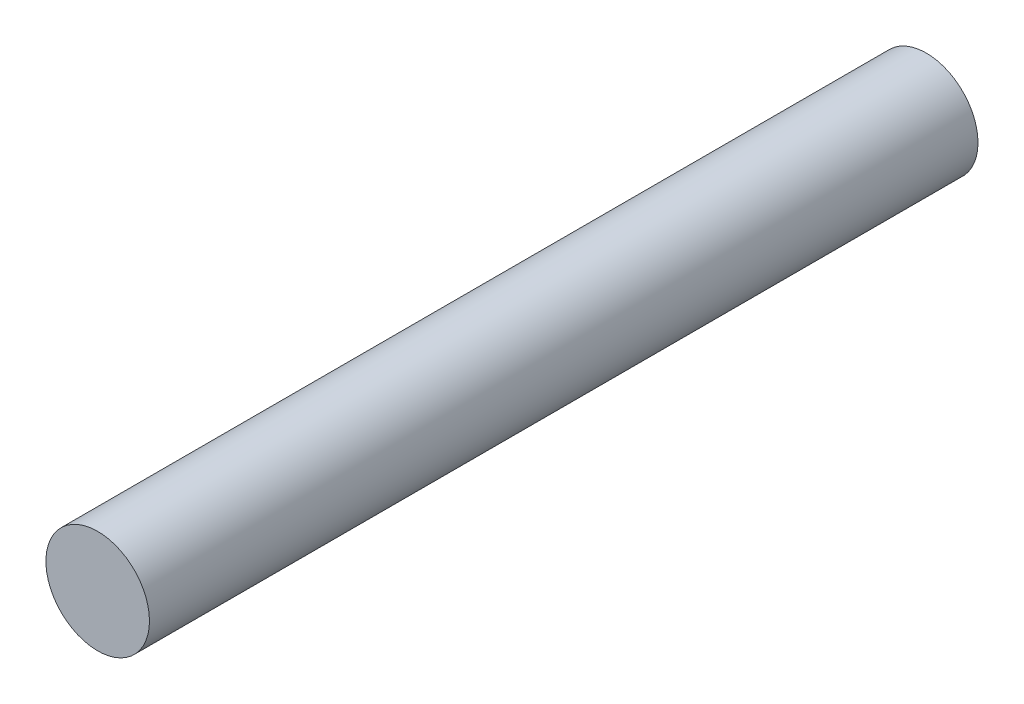
ISO-10303-21;
HEADER;
FILE_DESCRIPTION(('STEP AP214'),'2;1');
FILE_NAME('part.step','',(''),(''),'','','');
FILE_SCHEMA(('AUTOMOTIVE_DESIGN { 1 0 10303 214 1 1 1 1 }'));
ENDSEC;
DATA;
#1=APPLICATION_CONTEXT('core data for automotive mechanical design processes');
#2=APPLICATION_PROTOCOL_DEFINITION('international standard','automotive_design',2000,#1);
#3=PRODUCT_CONTEXT('',#1,'mechanical');
#4=PRODUCT('Part','Part','',(#3));
#5=PRODUCT_RELATED_PRODUCT_CATEGORY('part','',(#4));
#6=PRODUCT_DEFINITION_FORMATION('','',#4);
#7=PRODUCT_DEFINITION_CONTEXT('part definition',#1,'design');
#8=PRODUCT_DEFINITION('design','',#6,#7);
#9=PRODUCT_DEFINITION_SHAPE('','',#8);
#10=(LENGTH_UNIT() NAMED_UNIT(*) SI_UNIT(.MILLI.,.METRE.));
#11=(NAMED_UNIT(*) PLANE_ANGLE_UNIT() SI_UNIT($,.RADIAN.));
#12=(NAMED_UNIT(*) SI_UNIT($,.STERADIAN.) SOLID_ANGLE_UNIT());
#13=UNCERTAINTY_MEASURE_WITH_UNIT(LENGTH_MEASURE(1.E-05),#10,'distance_accuracy_value','');
#14=(GEOMETRIC_REPRESENTATION_CONTEXT(3) GLOBAL_UNCERTAINTY_ASSIGNED_CONTEXT((#13)) GLOBAL_UNIT_ASSIGNED_CONTEXT((#10,
#11,#12)) REPRESENTATION_CONTEXT('',''));
#15=CARTESIAN_POINT('',(0.,0.,0.));
#16=DIRECTION('',(0.,0.,1.));
#17=DIRECTION('',(1.,0.,0.));
#18=AXIS2_PLACEMENT_3D('',#15,#16,#17);
#19=CARTESIAN_POINT('',(0.,0.,40.));
#20=DIRECTION('',(0.,0.,-1.));
#21=DIRECTION('',(-1.,0.,0.));
#22=AXIS2_PLACEMENT_3D('',#19,#20,#21);
#23=CYLINDRICAL_SURFACE('',#22,2.5);
#24=CARTESIAN_POINT('',(0.,0.,40.));
#25=DIRECTION('',(0.,0.,1.));
#26=DIRECTION('',(1.,0.,0.));
#27=AXIS2_PLACEMENT_3D('',#24,#25,#26);
#28=CIRCLE('',#27,2.5);
#29=CARTESIAN_POINT('',(2.5,0.,40.));
#30=VERTEX_POINT('',#29);
#31=EDGE_CURVE('E10',#30,#30,#28,.T.);
#32=ORIENTED_EDGE('',*,*,#31,.F.);
#33=EDGE_LOOP('',(#32));
#34=FACE_BOUND('',#33,.T.);
#35=CARTESIAN_POINT('',(0.,0.,0.));
#36=DIRECTION('',(0.,0.,1.));
#37=DIRECTION('',(1.,0.,0.));
#38=AXIS2_PLACEMENT_3D('',#35,#36,#37);
#39=CIRCLE('',#38,2.5);
#40=CARTESIAN_POINT('',(2.5,0.,0.));
#41=VERTEX_POINT('',#40);
#42=EDGE_CURVE('E35',#41,#41,#39,.T.);
#43=ORIENTED_EDGE('',*,*,#42,.T.);
#44=EDGE_LOOP('',(#43));
#45=FACE_BOUND('',#44,.T.);
#46=ADVANCED_FACE('F32',(#34,#45),#23,.T.);
#47=CARTESIAN_POINT('',(0.,0.,40.));
#48=DIRECTION('',(0.,0.,1.));
#49=DIRECTION('',(1.,0.,0.));
#50=AXIS2_PLACEMENT_3D('',#47,#48,#49);
#51=PLANE('',#50);
#52=ORIENTED_EDGE('',*,*,#31,.T.);
#53=EDGE_LOOP('',(#52));
#54=FACE_BOUND('',#53,.T.);
#55=ADVANCED_FACE('F47',(#54),#51,.T.);
#56=CARTESIAN_POINT('',(0.,0.,0.));
#57=DIRECTION('',(0.,0.,1.));
#58=DIRECTION('',(1.,0.,0.));
#59=AXIS2_PLACEMENT_3D('',#56,#57,#58);
#60=PLANE('',#59);
#61=ORIENTED_EDGE('',*,*,#42,.F.);
#62=EDGE_LOOP('',(#61));
#63=FACE_BOUND('',#62,.T.);
#64=ADVANCED_FACE('F45',(#63),#60,.F.);
#65=CLOSED_SHELL('',(#46,#55,#64));
#66=MANIFOLD_SOLID_BREP('B2',#65);
#67=ADVANCED_BREP_SHAPE_REPRESENTATION('',(#18,#66),#14);
#68=SHAPE_DEFINITION_REPRESENTATION(#9,#67);
ENDSEC;
END-ISO-10303-21;
